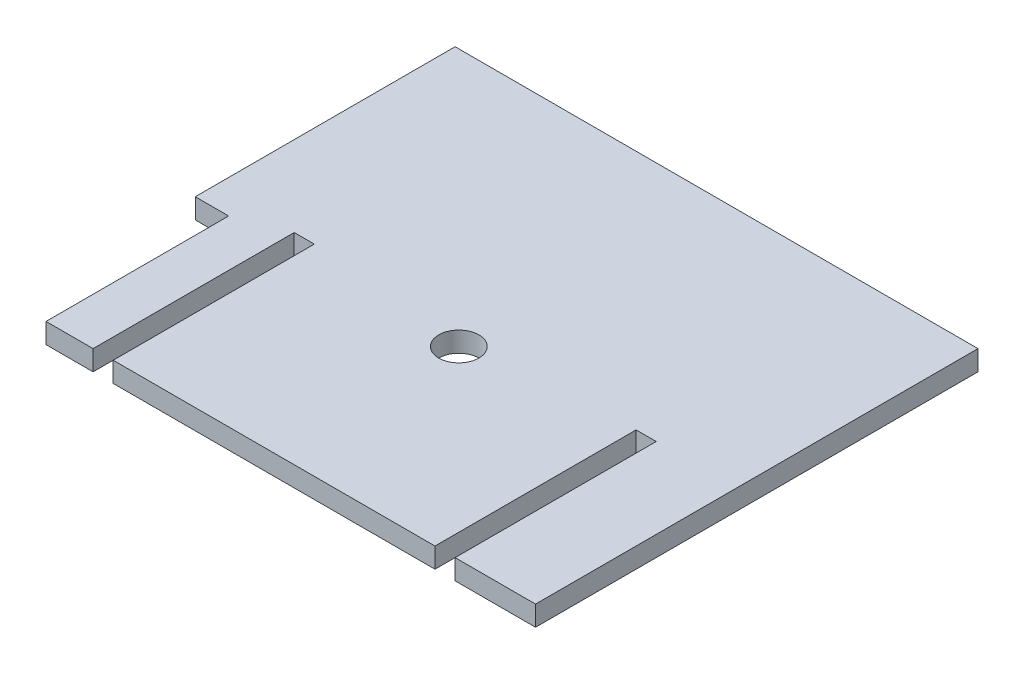
ISO-10303-21;
HEADER;
FILE_DESCRIPTION(('STEP AP214'),'2;1');
FILE_NAME('part.step','',(''),(''),'','','');
FILE_SCHEMA(('AUTOMOTIVE_DESIGN { 1 0 10303 214 1 1 1 1 }'));
ENDSEC;
DATA;
#1=APPLICATION_CONTEXT('core data for automotive mechanical design processes');
#2=APPLICATION_PROTOCOL_DEFINITION('international standard','automotive_design',2000,#1);
#3=PRODUCT_CONTEXT('',#1,'mechanical');
#4=PRODUCT('Part','Part','',(#3));
#5=PRODUCT_RELATED_PRODUCT_CATEGORY('part','',(#4));
#6=PRODUCT_DEFINITION_FORMATION('','',#4);
#7=PRODUCT_DEFINITION_CONTEXT('part definition',#1,'design');
#8=PRODUCT_DEFINITION('design','',#6,#7);
#9=PRODUCT_DEFINITION_SHAPE('','',#8);
#10=(LENGTH_UNIT() NAMED_UNIT(*) SI_UNIT(.MILLI.,.METRE.));
#11=(NAMED_UNIT(*) PLANE_ANGLE_UNIT() SI_UNIT($,.RADIAN.));
#12=(NAMED_UNIT(*) SI_UNIT($,.STERADIAN.) SOLID_ANGLE_UNIT());
#13=UNCERTAINTY_MEASURE_WITH_UNIT(LENGTH_MEASURE(1.E-05),#10,'distance_accuracy_value','');
#14=(GEOMETRIC_REPRESENTATION_CONTEXT(3) GLOBAL_UNCERTAINTY_ASSIGNED_CONTEXT((#13)) GLOBAL_UNIT_ASSIGNED_CONTEXT((#10,
#11,#12)) REPRESENTATION_CONTEXT('',''));
#15=CARTESIAN_POINT('',(0.,0.,0.));
#16=DIRECTION('',(0.,0.,1.));
#17=DIRECTION('',(1.,0.,0.));
#18=AXIS2_PLACEMENT_3D('',#15,#16,#17);
#19=CARTESIAN_POINT('',(798.399999999964,311.15,0.));
#20=DIRECTION('',(1.,0.,0.));
#21=DIRECTION('',(0.,0.,-1.));
#22=AXIS2_PLACEMENT_3D('',#19,#20,#21);
#23=PLANE('',#22);
#24=DIRECTION('',(0.,0.,1.));
#25=VECTOR('',#24,1.);
#26=CARTESIAN_POINT('',(798.399999999964,298.45,0.));
#27=LINE('',#26,#25);
#28=CARTESIAN_POINT('',(798.399999999964,298.45,-260.35));
#29=VERTEX_POINT('',#28);
#30=CARTESIAN_POINT('',(798.399999999964,298.45,-133.35));
#31=VERTEX_POINT('',#30);
#32=EDGE_CURVE('E242',#29,#31,#27,.T.);
#33=ORIENTED_EDGE('',*,*,#32,.T.);
#34=DIRECTION('',(0.,-1.,0.));
#35=VECTOR('',#34,1.);
#36=CARTESIAN_POINT('',(798.399999999964,311.15,-133.35));
#37=LINE('',#36,#35);
#38=CARTESIAN_POINT('',(798.399999999964,311.15,-133.35));
#39=VERTEX_POINT('',#38);
#40=EDGE_CURVE('E241',#39,#31,#37,.T.);
#41=ORIENTED_EDGE('',*,*,#40,.F.);
#42=DIRECTION('',(0.,0.,1.));
#43=VECTOR('',#42,1.);
#44=CARTESIAN_POINT('',(798.399999999964,311.15,0.));
#45=LINE('',#44,#43);
#46=CARTESIAN_POINT('',(798.399999999964,311.15,-260.35));
#47=VERTEX_POINT('',#46);
#48=EDGE_CURVE('E205',#47,#39,#45,.T.);
#49=ORIENTED_EDGE('',*,*,#48,.F.);
#50=DIRECTION('',(0.,-1.,0.));
#51=VECTOR('',#50,1.);
#52=CARTESIAN_POINT('',(798.399999999964,311.15,-260.35));
#53=LINE('',#52,#51);
#54=EDGE_CURVE('E106',#47,#29,#53,.T.);
#55=ORIENTED_EDGE('',*,*,#54,.T.);
#56=EDGE_LOOP('',(#33,#41,#49,#55));
#57=FACE_BOUND('',#56,.T.);
#58=ADVANCED_FACE('F45',(#57),#23,.F.);
#59=CARTESIAN_POINT('',(0.,311.15,-133.35));
#60=DIRECTION('',(0.,0.,1.));
#61=DIRECTION('',(1.,0.,0.));
#62=AXIS2_PLACEMENT_3D('',#59,#60,#61);
#63=PLANE('',#62);
#64=DIRECTION('',(-1.,0.,0.));
#65=VECTOR('',#64,1.);
#66=CARTESIAN_POINT('',(0.,298.45,-133.35));
#67=LINE('',#66,#65);
#68=CARTESIAN_POINT('',(1001.59999999996,298.45,-133.35));
#69=VERTEX_POINT('',#68);
#70=EDGE_CURVE('E251',#69,#31,#67,.T.);
#71=ORIENTED_EDGE('',*,*,#70,.F.);
#72=DIRECTION('',(0.,-1.,0.));
#73=VECTOR('',#72,1.);
#74=CARTESIAN_POINT('',(1001.59999999996,311.15,-133.35));
#75=LINE('',#74,#73);
#76=CARTESIAN_POINT('',(1001.59999999996,311.15,-133.35));
#77=VERTEX_POINT('',#76);
#78=EDGE_CURVE('E234',#77,#69,#75,.T.);
#79=ORIENTED_EDGE('',*,*,#78,.F.);
#80=DIRECTION('',(-1.,0.,0.));
#81=VECTOR('',#80,1.);
#82=CARTESIAN_POINT('',(0.,311.15,-133.35));
#83=LINE('',#82,#81);
#84=EDGE_CURVE('E237',#77,#39,#83,.T.);
#85=ORIENTED_EDGE('',*,*,#84,.T.);
#86=ORIENTED_EDGE('',*,*,#40,.T.);
#87=EDGE_LOOP('',(#71,#79,#85,#86));
#88=FACE_BOUND('',#87,.T.);
#89=ADVANCED_FACE('F360',(#88),#63,.T.);
#90=CARTESIAN_POINT('',(1001.59999999996,311.15,0.));
#91=DIRECTION('',(-1.,0.,0.));
#92=DIRECTION('',(0.,0.,1.));
#93=AXIS2_PLACEMENT_3D('',#90,#91,#92);
#94=PLANE('',#93);
#95=DIRECTION('',(0.,0.,-1.));
#96=VECTOR('',#95,1.);
#97=CARTESIAN_POINT('',(1001.59999999996,298.45,0.));
#98=LINE('',#97,#96);
#99=CARTESIAN_POINT('',(1001.59999999996,298.45,-260.35));
#100=VERTEX_POINT('',#99);
#101=EDGE_CURVE('E272',#69,#100,#98,.T.);
#102=ORIENTED_EDGE('',*,*,#101,.T.);
#103=DIRECTION('',(0.,-1.,0.));
#104=VECTOR('',#103,1.);
#105=CARTESIAN_POINT('',(1001.59999999996,311.15,-260.35));
#106=LINE('',#105,#104);
#107=CARTESIAN_POINT('',(1001.59999999996,311.15,-260.35));
#108=VERTEX_POINT('',#107);
#109=EDGE_CURVE('E233',#108,#100,#106,.T.);
#110=ORIENTED_EDGE('',*,*,#109,.F.);
#111=DIRECTION('',(0.,0.,-1.));
#112=VECTOR('',#111,1.);
#113=CARTESIAN_POINT('',(1001.59999999996,311.15,0.));
#114=LINE('',#113,#112);
#115=EDGE_CURVE('E208',#77,#108,#114,.T.);
#116=ORIENTED_EDGE('',*,*,#115,.F.);
#117=ORIENTED_EDGE('',*,*,#78,.T.);
#118=EDGE_LOOP('',(#102,#110,#116,#117));
#119=FACE_BOUND('',#118,.T.);
#120=ADVANCED_FACE('F353',(#119),#94,.F.);
#121=CARTESIAN_POINT('',(-2.2759572004815E-12,311.15,-260.349999999991));
#122=DIRECTION('',(0.,0.,1.));
#123=DIRECTION('',(1.,0.,0.));
#124=AXIS2_PLACEMENT_3D('',#121,#122,#123);
#125=PLANE('',#124);
#126=DIRECTION('',(-1.,0.,0.));
#127=VECTOR('',#126,1.);
#128=CARTESIAN_POINT('',(-2.2759572004815E-12,298.45,-260.349999999991));
#129=LINE('',#128,#127);
#130=CARTESIAN_POINT('',(1014.29999999996,298.45,-260.35));
#131=VERTEX_POINT('',#130);
#132=EDGE_CURVE('E265',#131,#100,#129,.T.);
#133=ORIENTED_EDGE('',*,*,#132,.F.);
#134=DIRECTION('',(0.,-1.,0.));
#135=VECTOR('',#134,1.);
#136=CARTESIAN_POINT('',(1014.29999999996,311.15,-260.35));
#137=LINE('',#136,#135);
#138=CARTESIAN_POINT('',(1014.29999999996,311.15,-260.35));
#139=VERTEX_POINT('',#138);
#140=EDGE_CURVE('E163',#139,#131,#137,.T.);
#141=ORIENTED_EDGE('',*,*,#140,.F.);
#142=DIRECTION('',(-1.,0.,0.));
#143=VECTOR('',#142,1.);
#144=CARTESIAN_POINT('',(-2.2759572004815E-12,311.15,-260.349999999991));
#145=LINE('',#144,#143);
#146=EDGE_CURVE('E229',#139,#108,#145,.T.);
#147=ORIENTED_EDGE('',*,*,#146,.T.);
#148=ORIENTED_EDGE('',*,*,#109,.T.);
#149=EDGE_LOOP('',(#133,#141,#147,#148));
#150=FACE_BOUND('',#149,.T.);
#151=ADVANCED_FACE('F418',(#150),#125,.T.);
#152=CARTESIAN_POINT('',(1014.29999999996,311.15,0.));
#153=DIRECTION('',(1.,0.,0.));
#154=DIRECTION('',(0.,0.,-1.));
#155=AXIS2_PLACEMENT_3D('',#152,#153,#154);
#156=PLANE('',#155);
#157=DIRECTION('',(0.,0.,1.));
#158=VECTOR('',#157,1.);
#159=CARTESIAN_POINT('',(1014.29999999996,298.45,0.));
#160=LINE('',#159,#158);
#161=CARTESIAN_POINT('',(1014.29999999996,298.45,-133.35));
#162=VERTEX_POINT('',#161);
#163=EDGE_CURVE('E266',#131,#162,#160,.T.);
#164=ORIENTED_EDGE('',*,*,#163,.T.);
#165=DIRECTION('',(0.,-1.,0.));
#166=VECTOR('',#165,1.);
#167=CARTESIAN_POINT('',(1014.29999999996,311.15,-133.35));
#168=LINE('',#167,#166);
#169=CARTESIAN_POINT('',(1014.29999999996,311.15,-133.35));
#170=VERTEX_POINT('',#169);
#171=EDGE_CURVE('E223',#170,#162,#168,.T.);
#172=ORIENTED_EDGE('',*,*,#171,.F.);
#173=DIRECTION('',(0.,0.,1.));
#174=VECTOR('',#173,1.);
#175=CARTESIAN_POINT('',(1014.29999999996,311.15,0.));
#176=LINE('',#175,#174);
#177=EDGE_CURVE('E218',#139,#170,#176,.T.);
#178=ORIENTED_EDGE('',*,*,#177,.F.);
#179=ORIENTED_EDGE('',*,*,#140,.T.);
#180=EDGE_LOOP('',(#164,#172,#178,#179));
#181=FACE_BOUND('',#180,.T.);
#182=ADVANCED_FACE('F424',(#181),#156,.F.);
#183=CARTESIAN_POINT('',(0.,311.15,-133.35));
#184=DIRECTION('',(0.,0.,1.));
#185=DIRECTION('',(1.,0.,0.));
#186=AXIS2_PLACEMENT_3D('',#183,#184,#185);
#187=PLANE('',#186);
#188=DIRECTION('',(-1.,0.,0.));
#189=VECTOR('',#188,1.);
#190=CARTESIAN_POINT('',(0.,298.45,-133.35));
#191=LINE('',#190,#189);
#192=CARTESIAN_POINT('',(1065.09999999996,298.45,-133.35));
#193=VERTEX_POINT('',#192);
#194=EDGE_CURVE('E260',#193,#162,#191,.T.);
#195=ORIENTED_EDGE('',*,*,#194,.F.);
#196=DIRECTION('',(0.,-1.,0.));
#197=VECTOR('',#196,1.);
#198=CARTESIAN_POINT('',(1065.09999999996,311.15,-133.35));
#199=LINE('',#198,#197);
#200=CARTESIAN_POINT('',(1065.09999999996,311.15,-133.35));
#201=VERTEX_POINT('',#200);
#202=EDGE_CURVE('E152',#201,#193,#199,.T.);
#203=ORIENTED_EDGE('',*,*,#202,.F.);
#204=DIRECTION('',(-1.,0.,0.));
#205=VECTOR('',#204,1.);
#206=CARTESIAN_POINT('',(0.,311.15,-133.35));
#207=LINE('',#206,#205);
#208=EDGE_CURVE('E224',#201,#170,#207,.T.);
#209=ORIENTED_EDGE('',*,*,#208,.T.);
#210=ORIENTED_EDGE('',*,*,#171,.T.);
#211=EDGE_LOOP('',(#195,#203,#209,#210));
#212=FACE_BOUND('',#211,.T.);
#213=ADVANCED_FACE('F427',(#212),#187,.T.);
#214=CARTESIAN_POINT('',(1065.09999999996,311.15,0.));
#215=DIRECTION('',(1.,0.,0.));
#216=DIRECTION('',(0.,0.,-1.));
#217=AXIS2_PLACEMENT_3D('',#214,#215,#216);
#218=PLANE('',#217);
#219=DIRECTION('',(0.,0.,1.));
#220=VECTOR('',#219,1.);
#221=CARTESIAN_POINT('',(1065.09999999996,298.45,0.));
#222=LINE('',#221,#220);
#223=CARTESIAN_POINT('',(1065.09999999996,298.45,-412.75));
#224=VERTEX_POINT('',#223);
#225=EDGE_CURVE('E257',#224,#193,#222,.T.);
#226=ORIENTED_EDGE('',*,*,#225,.F.);
#227=DIRECTION('',(0.,-1.,0.));
#228=VECTOR('',#227,1.);
#229=CARTESIAN_POINT('',(1065.09999999996,311.15,-412.75));
#230=LINE('',#229,#228);
#231=CARTESIAN_POINT('',(1065.09999999996,311.15,-412.75));
#232=VERTEX_POINT('',#231);
#233=EDGE_CURVE('E176',#232,#224,#230,.T.);
#234=ORIENTED_EDGE('',*,*,#233,.F.);
#235=DIRECTION('',(0.,0.,1.));
#236=VECTOR('',#235,1.);
#237=CARTESIAN_POINT('',(1065.09999999996,311.15,0.));
#238=LINE('',#237,#236);
#239=EDGE_CURVE('E219',#232,#201,#238,.T.);
#240=ORIENTED_EDGE('',*,*,#239,.T.);
#241=ORIENTED_EDGE('',*,*,#202,.T.);
#242=EDGE_LOOP('',(#226,#234,#240,#241));
#243=FACE_BOUND('',#242,.T.);
#244=ADVANCED_FACE('F437',(#243),#218,.T.);
#245=CARTESIAN_POINT('',(1.80411241501589E-12,311.15,-412.750000000003));
#246=DIRECTION('',(0.,0.,1.));
#247=DIRECTION('',(1.,0.,0.));
#248=AXIS2_PLACEMENT_3D('',#245,#246,#247);
#249=PLANE('',#248);
#250=DIRECTION('',(-1.,0.,0.));
#251=VECTOR('',#250,1.);
#252=CARTESIAN_POINT('',(1.80411241501589E-12,298.45,-412.750000000003));
#253=LINE('',#252,#251);
#254=CARTESIAN_POINT('',(734.899999999964,298.45,-412.75));
#255=VERTEX_POINT('',#254);
#256=EDGE_CURVE('E178',#224,#255,#253,.T.);
#257=ORIENTED_EDGE('',*,*,#256,.T.);
#258=DIRECTION('',(0.,-1.,0.));
#259=VECTOR('',#258,1.);
#260=CARTESIAN_POINT('',(734.899999999964,311.15,-412.75));
#261=LINE('',#260,#259);
#262=CARTESIAN_POINT('',(734.899999999964,311.15,-412.75));
#263=VERTEX_POINT('',#262);
#264=EDGE_CURVE('E181',#263,#255,#261,.T.);
#265=ORIENTED_EDGE('',*,*,#264,.F.);
#266=DIRECTION('',(-1.,0.,0.));
#267=VECTOR('',#266,1.);
#268=CARTESIAN_POINT('',(1.80411241501589E-12,311.15,-412.750000000003));
#269=LINE('',#268,#267);
#270=EDGE_CURVE('E77',#232,#263,#269,.T.);
#271=ORIENTED_EDGE('',*,*,#270,.F.);
#272=ORIENTED_EDGE('',*,*,#233,.T.);
#273=EDGE_LOOP('',(#257,#265,#271,#272));
#274=FACE_BOUND('',#273,.T.);
#275=ADVANCED_FACE('F180',(#274),#249,.F.);
#276=CARTESIAN_POINT('',(734.899999999964,311.15,0.));
#277=DIRECTION('',(1.,0.,0.));
#278=DIRECTION('',(0.,0.,-1.));
#279=AXIS2_PLACEMENT_3D('',#276,#277,#278);
#280=PLANE('',#279);
#281=DIRECTION('',(0.,0.,1.));
#282=VECTOR('',#281,1.);
#283=CARTESIAN_POINT('',(734.899999999964,298.45,0.));
#284=LINE('',#283,#282);
#285=CARTESIAN_POINT('',(734.899999999964,298.45,-248.675364530192));
#286=VERTEX_POINT('',#285);
#287=EDGE_CURVE('E192',#255,#286,#284,.T.);
#288=ORIENTED_EDGE('',*,*,#287,.T.);
#289=DIRECTION('',(0.,1.,0.));
#290=VECTOR('',#289,1.);
#291=CARTESIAN_POINT('',(734.899999999964,298.45,-248.675364530192));
#292=LINE('',#291,#290);
#293=CARTESIAN_POINT('',(734.899999999964,311.15,-248.675364530192));
#294=VERTEX_POINT('',#293);
#295=EDGE_CURVE('E246',#286,#294,#292,.T.);
#296=ORIENTED_EDGE('',*,*,#295,.T.);
#297=DIRECTION('',(0.,0.,1.));
#298=VECTOR('',#297,1.);
#299=CARTESIAN_POINT('',(734.899999999964,311.15,0.));
#300=LINE('',#299,#298);
#301=EDGE_CURVE('E49',#263,#294,#300,.T.);
#302=ORIENTED_EDGE('',*,*,#301,.F.);
#303=ORIENTED_EDGE('',*,*,#264,.T.);
#304=EDGE_LOOP('',(#288,#296,#302,#303));
#305=FACE_BOUND('',#304,.T.);
#306=ADVANCED_FACE('F47',(#305),#280,.F.);
#307=CARTESIAN_POINT('',(1.45716771982053E-13,311.15,-133.350000000001));
#308=DIRECTION('',(0.,0.,1.));
#309=DIRECTION('',(1.,0.,0.));
#310=AXIS2_PLACEMENT_3D('',#307,#308,#309);
#311=PLANE('',#310);
#312=DIRECTION('',(0.,1.,0.));
#313=VECTOR('',#312,1.);
#314=CARTESIAN_POINT('',(755.968746235558,298.45,-133.35));
#315=LINE('',#314,#313);
#316=CARTESIAN_POINT('',(755.968746235558,298.45,-133.35));
#317=VERTEX_POINT('',#316);
#318=CARTESIAN_POINT('',(755.968746235558,311.15,-133.35));
#319=VERTEX_POINT('',#318);
#320=EDGE_CURVE('E304',#317,#319,#315,.T.);
#321=ORIENTED_EDGE('',*,*,#320,.F.);
#322=DIRECTION('',(-1.,0.,0.));
#323=VECTOR('',#322,1.);
#324=CARTESIAN_POINT('',(1.45716771982053E-13,298.45,-133.350000000001));
#325=LINE('',#324,#323);
#326=CARTESIAN_POINT('',(785.699999999964,298.45,-133.35));
#327=VERTEX_POINT('',#326);
#328=EDGE_CURVE('E55',#327,#317,#325,.T.);
#329=ORIENTED_EDGE('',*,*,#328,.F.);
#330=DIRECTION('',(0.,-1.,0.));
#331=VECTOR('',#330,1.);
#332=CARTESIAN_POINT('',(785.699999999964,311.15,-133.35));
#333=LINE('',#332,#331);
#334=CARTESIAN_POINT('',(785.699999999964,311.15,-133.35));
#335=VERTEX_POINT('',#334);
#336=EDGE_CURVE('E117',#335,#327,#333,.T.);
#337=ORIENTED_EDGE('',*,*,#336,.F.);
#338=DIRECTION('',(-1.,0.,0.));
#339=VECTOR('',#338,1.);
#340=CARTESIAN_POINT('',(1.45716771982053E-13,311.15,-133.350000000001));
#341=LINE('',#340,#339);
#342=EDGE_CURVE('E199',#335,#319,#341,.T.);
#343=ORIENTED_EDGE('',*,*,#342,.T.);
#344=EDGE_LOOP('',(#321,#329,#337,#343));
#345=FACE_BOUND('',#344,.T.);
#346=ADVANCED_FACE('F335',(#345),#311,.T.);
#347=CARTESIAN_POINT('',(785.699999999964,311.15,0.));
#348=DIRECTION('',(-1.,0.,0.));
#349=DIRECTION('',(0.,0.,1.));
#350=AXIS2_PLACEMENT_3D('',#347,#348,#349);
#351=PLANE('',#350);
#352=DIRECTION('',(0.,0.,-1.));
#353=VECTOR('',#352,1.);
#354=CARTESIAN_POINT('',(785.699999999964,298.45,0.));
#355=LINE('',#354,#353);
#356=CARTESIAN_POINT('',(785.699999999964,298.45,-260.35));
#357=VERTEX_POINT('',#356);
#358=EDGE_CURVE('E202',#327,#357,#355,.T.);
#359=ORIENTED_EDGE('',*,*,#358,.T.);
#360=DIRECTION('',(0.,-1.,0.));
#361=VECTOR('',#360,1.);
#362=CARTESIAN_POINT('',(785.699999999964,311.15,-260.35));
#363=LINE('',#362,#361);
#364=CARTESIAN_POINT('',(785.699999999964,311.15,-260.35));
#365=VERTEX_POINT('',#364);
#366=EDGE_CURVE('E213',#365,#357,#363,.T.);
#367=ORIENTED_EDGE('',*,*,#366,.F.);
#368=DIRECTION('',(0.,0.,-1.));
#369=VECTOR('',#368,1.);
#370=CARTESIAN_POINT('',(785.699999999964,311.15,0.));
#371=LINE('',#370,#369);
#372=EDGE_CURVE('E209',#335,#365,#371,.T.);
#373=ORIENTED_EDGE('',*,*,#372,.F.);
#374=ORIENTED_EDGE('',*,*,#336,.T.);
#375=EDGE_LOOP('',(#359,#367,#373,#374));
#376=FACE_BOUND('',#375,.T.);
#377=ADVANCED_FACE('F364',(#376),#351,.F.);
#378=CARTESIAN_POINT('',(0.,311.15,-260.35));
#379=DIRECTION('',(0.,0.,1.));
#380=DIRECTION('',(1.,0.,0.));
#381=AXIS2_PLACEMENT_3D('',#378,#379,#380);
#382=PLANE('',#381);
#383=DIRECTION('',(-1.,0.,0.));
#384=VECTOR('',#383,1.);
#385=CARTESIAN_POINT('',(0.,298.45,-260.35));
#386=LINE('',#385,#384);
#387=EDGE_CURVE('E247',#29,#357,#386,.T.);
#388=ORIENTED_EDGE('',*,*,#387,.F.);
#389=ORIENTED_EDGE('',*,*,#54,.F.);
#390=DIRECTION('',(-1.,0.,0.));
#391=VECTOR('',#390,1.);
#392=CARTESIAN_POINT('',(0.,311.15,-260.35));
#393=LINE('',#392,#391);
#394=EDGE_CURVE('E210',#47,#365,#393,.T.);
#395=ORIENTED_EDGE('',*,*,#394,.T.);
#396=ORIENTED_EDGE('',*,*,#366,.T.);
#397=EDGE_LOOP('',(#388,#389,#395,#396));
#398=FACE_BOUND('',#397,.T.);
#399=ADVANCED_FACE('F363',(#398),#382,.T.);
#400=CARTESIAN_POINT('',(0.,311.15,0.));
#401=DIRECTION('',(0.,-1.,0.));
#402=DIRECTION('',(0.,0.,-1.));
#403=AXIS2_PLACEMENT_3D('',#400,#401,#402);
#404=PLANE('',#403);
#405=ORIENTED_EDGE('',*,*,#301,.T.);
#406=DIRECTION('',(-1.,0.,0.));
#407=VECTOR('',#406,1.);
#408=CARTESIAN_POINT('',(734.899999999964,311.15,-248.675364530192));
#409=LINE('',#408,#407);
#410=CARTESIAN_POINT('',(755.968746235558,311.15,-248.675364530192));
#411=VERTEX_POINT('',#410);
#412=EDGE_CURVE('E312',#411,#294,#409,.T.);
#413=ORIENTED_EDGE('',*,*,#412,.F.);
#414=DIRECTION('',(0.,0.,-1.));
#415=VECTOR('',#414,1.);
#416=CARTESIAN_POINT('',(755.968746235558,311.15,-133.35));
#417=LINE('',#416,#415);
#418=EDGE_CURVE('E316',#319,#411,#417,.T.);
#419=ORIENTED_EDGE('',*,*,#418,.F.);
#420=ORIENTED_EDGE('',*,*,#342,.F.);
#421=ORIENTED_EDGE('',*,*,#372,.T.);
#422=ORIENTED_EDGE('',*,*,#394,.F.);
#423=ORIENTED_EDGE('',*,*,#48,.T.);
#424=ORIENTED_EDGE('',*,*,#84,.F.);
#425=ORIENTED_EDGE('',*,*,#115,.T.);
#426=ORIENTED_EDGE('',*,*,#146,.F.);
#427=ORIENTED_EDGE('',*,*,#177,.T.);
#428=ORIENTED_EDGE('',*,*,#208,.F.);
#429=ORIENTED_EDGE('',*,*,#239,.F.);
#430=ORIENTED_EDGE('',*,*,#270,.T.);
#431=EDGE_LOOP('',(#405,#413,#419,#420,#421,#422,#423,#424,#425,#426,#427,#428,#429,#430));
#432=FACE_BOUND('',#431,.T.);
#433=CARTESIAN_POINT('',(899.999999999999,311.15,-249.999999999998));
#434=DIRECTION('',(0.,-1.,0.));
#435=DIRECTION('',(0.,0.,-1.));
#436=AXIS2_PLACEMENT_3D('',#433,#434,#435);
#437=CIRCLE('',#436,12.7);
#438=CARTESIAN_POINT('',(899.999999999999,311.15,-262.699999999998));
#439=VERTEX_POINT('',#438);
#440=EDGE_CURVE('E11',#439,#439,#437,.F.);
#441=ORIENTED_EDGE('',*,*,#440,.F.);
#442=EDGE_LOOP('',(#441));
#443=FACE_BOUND('',#442,.T.);
#444=ADVANCED_FACE('F340',(#432,#443),#404,.F.);
#445=CARTESIAN_POINT('',(0.,298.45,0.));
#446=DIRECTION('',(0.,-1.,0.));
#447=DIRECTION('',(0.,0.,-1.));
#448=AXIS2_PLACEMENT_3D('',#445,#446,#447);
#449=PLANE('',#448);
#450=DIRECTION('',(-1.,0.,0.));
#451=VECTOR('',#450,1.);
#452=CARTESIAN_POINT('',(734.899999999964,298.45,-248.675364530192));
#453=LINE('',#452,#451);
#454=CARTESIAN_POINT('',(755.968746235558,298.45,-248.675364530192));
#455=VERTEX_POINT('',#454);
#456=EDGE_CURVE('E66',#455,#286,#453,.T.);
#457=ORIENTED_EDGE('',*,*,#456,.T.);
#458=ORIENTED_EDGE('',*,*,#287,.F.);
#459=ORIENTED_EDGE('',*,*,#256,.F.);
#460=ORIENTED_EDGE('',*,*,#225,.T.);
#461=ORIENTED_EDGE('',*,*,#194,.T.);
#462=ORIENTED_EDGE('',*,*,#163,.F.);
#463=ORIENTED_EDGE('',*,*,#132,.T.);
#464=ORIENTED_EDGE('',*,*,#101,.F.);
#465=ORIENTED_EDGE('',*,*,#70,.T.);
#466=ORIENTED_EDGE('',*,*,#32,.F.);
#467=ORIENTED_EDGE('',*,*,#387,.T.);
#468=ORIENTED_EDGE('',*,*,#358,.F.);
#469=ORIENTED_EDGE('',*,*,#328,.T.);
#470=DIRECTION('',(0.,0.,-1.));
#471=VECTOR('',#470,1.);
#472=CARTESIAN_POINT('',(755.968746235558,298.45,-133.35));
#473=LINE('',#472,#471);
#474=EDGE_CURVE('E315',#317,#455,#473,.T.);
#475=ORIENTED_EDGE('',*,*,#474,.T.);
#476=EDGE_LOOP('',(#457,#458,#459,#460,#461,#462,#463,#464,#465,#466,#467,#468,#469,#475));
#477=FACE_BOUND('',#476,.T.);
#478=CARTESIAN_POINT('',(899.999999999999,298.45,-249.999999999998));
#479=DIRECTION('',(0.,-1.,0.));
#480=DIRECTION('',(0.,0.,-1.));
#481=AXIS2_PLACEMENT_3D('',#478,#479,#480);
#482=CIRCLE('',#481,12.7);
#483=CARTESIAN_POINT('',(899.999999999999,298.45,-262.699999999998));
#484=VERTEX_POINT('',#483);
#485=EDGE_CURVE('E261',#484,#484,#482,.F.);
#486=ORIENTED_EDGE('',*,*,#485,.T.);
#487=EDGE_LOOP('',(#486));
#488=FACE_BOUND('',#487,.T.);
#489=ADVANCED_FACE('F195',(#477,#488),#449,.T.);
#490=CARTESIAN_POINT('',(899.999999999999,420.499546279127,-249.999999999998));
#491=DIRECTION('',(0.,-1.,0.));
#492=DIRECTION('',(0.,0.,-1.));
#493=AXIS2_PLACEMENT_3D('',#490,#491,#492);
#494=CYLINDRICAL_SURFACE('',#493,12.7);
#495=ORIENTED_EDGE('',*,*,#485,.F.);
#496=EDGE_LOOP('',(#495));
#497=FACE_BOUND('',#496,.T.);
#498=ORIENTED_EDGE('',*,*,#440,.T.);
#499=EDGE_LOOP('',(#498));
#500=FACE_BOUND('',#499,.T.);
#501=ADVANCED_FACE('F384',(#497,#500),#494,.F.);
#502=CARTESIAN_POINT('',(734.899999999964,298.45,-248.675364530192));
#503=DIRECTION('',(0.,0.,-1.));
#504=DIRECTION('',(-1.,0.,0.));
#505=AXIS2_PLACEMENT_3D('',#502,#503,#504);
#506=PLANE('',#505);
#507=ORIENTED_EDGE('',*,*,#412,.T.);
#508=ORIENTED_EDGE('',*,*,#295,.F.);
#509=ORIENTED_EDGE('',*,*,#456,.F.);
#510=DIRECTION('',(0.,1.,0.));
#511=VECTOR('',#510,1.);
#512=CARTESIAN_POINT('',(755.968746235558,298.45,-248.675364530192));
#513=LINE('',#512,#511);
#514=EDGE_CURVE('E308',#455,#411,#513,.T.);
#515=ORIENTED_EDGE('',*,*,#514,.T.);
#516=EDGE_LOOP('',(#507,#508,#509,#515));
#517=FACE_BOUND('',#516,.T.);
#518=ADVANCED_FACE('F382',(#517),#506,.F.);
#519=CARTESIAN_POINT('',(755.968746235558,298.45,-133.35));
#520=DIRECTION('',(1.,0.,0.));
#521=DIRECTION('',(0.,0.,-1.));
#522=AXIS2_PLACEMENT_3D('',#519,#520,#521);
#523=PLANE('',#522);
#524=ORIENTED_EDGE('',*,*,#418,.T.);
#525=ORIENTED_EDGE('',*,*,#514,.F.);
#526=ORIENTED_EDGE('',*,*,#474,.F.);
#527=ORIENTED_EDGE('',*,*,#320,.T.);
#528=EDGE_LOOP('',(#524,#525,#526,#527));
#529=FACE_BOUND('',#528,.T.);
#530=ADVANCED_FACE('F328',(#529),#523,.F.);
#531=CLOSED_SHELL('',(#58,#89,#120,#151,#182,#213,#244,#275,#306,#346,#377,#399,#444,#489,#501,
#518,#530));
#532=MANIFOLD_SOLID_BREP('B2',#531);
#533=ADVANCED_BREP_SHAPE_REPRESENTATION('',(#18,#532),#14);
#534=SHAPE_DEFINITION_REPRESENTATION(#9,#533);
ENDSEC;
END-ISO-10303-21;
